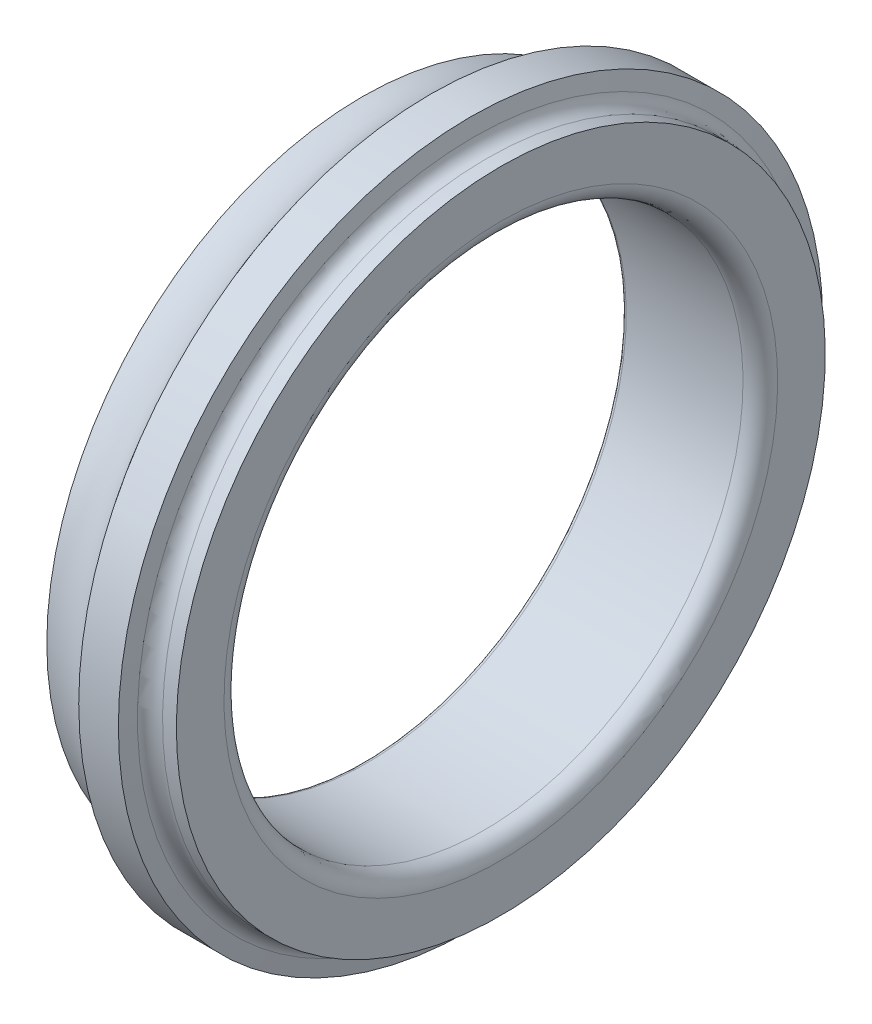
ISO-10303-21;
HEADER;
FILE_DESCRIPTION(('STEP AP214'),'2;1');
FILE_NAME('part.step','',(''),(''),'','','');
FILE_SCHEMA(('AUTOMOTIVE_DESIGN { 1 0 10303 214 1 1 1 1 }'));
ENDSEC;
DATA;
#1=APPLICATION_CONTEXT('core data for automotive mechanical design processes');
#2=APPLICATION_PROTOCOL_DEFINITION('international standard','automotive_design',2000,#1);
#3=PRODUCT_CONTEXT('',#1,'mechanical');
#4=PRODUCT('Part','Part','',(#3));
#5=PRODUCT_RELATED_PRODUCT_CATEGORY('part','',(#4));
#6=PRODUCT_DEFINITION_FORMATION('','',#4);
#7=PRODUCT_DEFINITION_CONTEXT('part definition',#1,'design');
#8=PRODUCT_DEFINITION('design','',#6,#7);
#9=PRODUCT_DEFINITION_SHAPE('','',#8);
#10=(LENGTH_UNIT() NAMED_UNIT(*) SI_UNIT(.MILLI.,.METRE.));
#11=(NAMED_UNIT(*) PLANE_ANGLE_UNIT() SI_UNIT($,.RADIAN.));
#12=(NAMED_UNIT(*) SI_UNIT($,.STERADIAN.) SOLID_ANGLE_UNIT());
#13=UNCERTAINTY_MEASURE_WITH_UNIT(LENGTH_MEASURE(1.E-05),#10,'distance_accuracy_value','');
#14=(GEOMETRIC_REPRESENTATION_CONTEXT(3) GLOBAL_UNCERTAINTY_ASSIGNED_CONTEXT((#13)) GLOBAL_UNIT_ASSIGNED_CONTEXT((#10,
#11,#12)) REPRESENTATION_CONTEXT('',''));
#15=CARTESIAN_POINT('',(0.,0.,0.));
#16=DIRECTION('',(0.,0.,1.));
#17=DIRECTION('',(1.,0.,0.));
#18=AXIS2_PLACEMENT_3D('',#15,#16,#17);
#19=CARTESIAN_POINT('',(8.,0.,0.));
#20=DIRECTION('',(-1.,0.,0.));
#21=DIRECTION('',(0.,0.,1.));
#22=AXIS2_PLACEMENT_3D('',#19,#20,#21);
#23=TOROIDAL_SURFACE('',#22,23.,4.7625);
#24=CARTESIAN_POINT('',(11.9571335901129,0.,0.));
#25=DIRECTION('',(-1.,0.,0.));
#26=DIRECTION('',(0.,1.,0.));
#27=AXIS2_PLACEMENT_3D('',#24,#25,#26);
#28=CIRCLE('',#27,20.35);
#29=CARTESIAN_POINT('',(11.9571335901129,20.35,0.));
#30=VERTEX_POINT('',#29);
#31=EDGE_CURVE('E11',#30,#30,#28,.T.);
#32=ORIENTED_EDGE('',*,*,#31,.T.);
#33=EDGE_LOOP('',(#32));
#34=FACE_BOUND('',#33,.T.);
#35=CARTESIAN_POINT('',(8.,0.,0.));
#36=DIRECTION('',(-1.,0.,0.));
#37=DIRECTION('',(0.,1.,0.));
#38=AXIS2_PLACEMENT_3D('',#35,#36,#37);
#39=CIRCLE('',#38,18.2375);
#40=CARTESIAN_POINT('',(8.,18.2375,0.));
#41=VERTEX_POINT('',#40);
#42=EDGE_CURVE('E59',#41,#41,#39,.T.);
#43=ORIENTED_EDGE('',*,*,#42,.F.);
#44=EDGE_LOOP('',(#43));
#45=FACE_BOUND('',#44,.T.);
#46=ADVANCED_FACE('F16',(#34,#45),#23,.F.);
#47=CARTESIAN_POINT('',(13.1018653580188,0.,0.));
#48=DIRECTION('',(1.,0.,0.));
#49=DIRECTION('',(0.,1.,0.));
#50=AXIS2_PLACEMENT_3D('',#47,#48,#49);
#51=CYLINDRICAL_SURFACE('',#50,20.35);
#52=CARTESIAN_POINT('',(14.2465971259246,0.,0.));
#53=DIRECTION('',(-1.,0.,0.));
#54=DIRECTION('',(0.,1.,0.));
#55=AXIS2_PLACEMENT_3D('',#52,#53,#54);
#56=CIRCLE('',#55,20.35);
#57=CARTESIAN_POINT('',(14.2465971259246,20.35,0.));
#58=VERTEX_POINT('',#57);
#59=EDGE_CURVE('E25',#58,#58,#56,.T.);
#60=ORIENTED_EDGE('',*,*,#59,.T.);
#61=EDGE_LOOP('',(#60));
#62=FACE_BOUND('',#61,.T.);
#63=ORIENTED_EDGE('',*,*,#31,.F.);
#64=EDGE_LOOP('',(#63));
#65=FACE_BOUND('',#64,.T.);
#66=ADVANCED_FACE('F88',(#62,#65),#51,.T.);
#67=CARTESIAN_POINT('',(14.3293754617574,0.,0.));
#68=DIRECTION('',(-1.,0.,0.));
#69=DIRECTION('',(0.,1.,0.));
#70=AXIS2_PLACEMENT_3D('',#67,#68,#69);
#71=CONICAL_SURFACE('',#70,19.8805407289332,1.39626340159546);
#72=CARTESIAN_POINT('',(14.4121537975902,0.,0.));
#73=DIRECTION('',(-1.,0.,0.));
#74=DIRECTION('',(0.,1.,0.));
#75=AXIS2_PLACEMENT_3D('',#72,#73,#74);
#76=CIRCLE('',#75,19.4110814578664);
#77=CARTESIAN_POINT('',(14.4121537975902,19.4110814578664,0.));
#78=VERTEX_POINT('',#77);
#79=EDGE_CURVE('E66',#78,#78,#76,.T.);
#80=ORIENTED_EDGE('',*,*,#79,.T.);
#81=EDGE_LOOP('',(#80));
#82=FACE_BOUND('',#81,.T.);
#83=ORIENTED_EDGE('',*,*,#59,.F.);
#84=EDGE_LOOP('',(#83));
#85=FACE_BOUND('',#84,.T.);
#86=ADVANCED_FACE('F92',(#82,#85),#71,.T.);
#87=CARTESIAN_POINT('',(15.2,0.,0.));
#88=DIRECTION('',(-1.,0.,0.));
#89=DIRECTION('',(0.,0.,1.));
#90=AXIS2_PLACEMENT_3D('',#87,#88,#89);
#91=TOROIDAL_SURFACE('',#90,19.55,0.8);
#92=CARTESIAN_POINT('',(15.2,0.,0.));
#93=DIRECTION('',(-1.,0.,0.));
#94=DIRECTION('',(0.,1.,0.));
#95=AXIS2_PLACEMENT_3D('',#92,#93,#94);
#96=CIRCLE('',#95,18.75);
#97=CARTESIAN_POINT('',(15.2,18.75,0.));
#98=VERTEX_POINT('',#97);
#99=EDGE_CURVE('E64',#98,#98,#96,.T.);
#100=ORIENTED_EDGE('',*,*,#99,.T.);
#101=EDGE_LOOP('',(#100));
#102=FACE_BOUND('',#101,.T.);
#103=ORIENTED_EDGE('',*,*,#79,.F.);
#104=EDGE_LOOP('',(#103));
#105=FACE_BOUND('',#104,.T.);
#106=ADVANCED_FACE('F100',(#102,#105),#91,.F.);
#107=CARTESIAN_POINT('',(15.6,0.,0.));
#108=DIRECTION('',(1.,0.,0.));
#109=DIRECTION('',(0.,1.,0.));
#110=AXIS2_PLACEMENT_3D('',#107,#108,#109);
#111=CYLINDRICAL_SURFACE('',#110,18.75);
#112=CARTESIAN_POINT('',(16.,0.,0.));
#113=DIRECTION('',(-1.,0.,0.));
#114=DIRECTION('',(0.,1.,0.));
#115=AXIS2_PLACEMENT_3D('',#112,#113,#114);
#116=CIRCLE('',#115,18.75);
#117=CARTESIAN_POINT('',(16.,18.75,0.));
#118=VERTEX_POINT('',#117);
#119=EDGE_CURVE('E67',#118,#118,#116,.T.);
#120=ORIENTED_EDGE('',*,*,#119,.T.);
#121=EDGE_LOOP('',(#120));
#122=FACE_BOUND('',#121,.T.);
#123=ORIENTED_EDGE('',*,*,#99,.F.);
#124=EDGE_LOOP('',(#123));
#125=FACE_BOUND('',#124,.T.);
#126=ADVANCED_FACE('F115',(#122,#125),#111,.T.);
#127=CARTESIAN_POINT('',(16.,17.375,0.));
#128=DIRECTION('',(1.,0.,0.));
#129=DIRECTION('',(0.,-1.,0.));
#130=AXIS2_PLACEMENT_3D('',#127,#128,#129);
#131=PLANE('',#130);
#132=CARTESIAN_POINT('',(16.,0.,0.));
#133=DIRECTION('',(-1.,0.,0.));
#134=DIRECTION('',(0.,1.,0.));
#135=AXIS2_PLACEMENT_3D('',#132,#133,#134);
#136=CIRCLE('',#135,16.);
#137=CARTESIAN_POINT('',(16.,16.,0.));
#138=VERTEX_POINT('',#137);
#139=EDGE_CURVE('E61',#138,#138,#136,.T.);
#140=ORIENTED_EDGE('',*,*,#139,.T.);
#141=EDGE_LOOP('',(#140));
#142=FACE_BOUND('',#141,.T.);
#143=ORIENTED_EDGE('',*,*,#119,.F.);
#144=EDGE_LOOP('',(#143));
#145=FACE_BOUND('',#144,.T.);
#146=ADVANCED_FACE('F110',(#142,#145),#131,.T.);
#147=CARTESIAN_POINT('',(15.,0.,0.));
#148=DIRECTION('',(-1.,0.,0.));
#149=DIRECTION('',(0.,0.,1.));
#150=AXIS2_PLACEMENT_3D('',#147,#148,#149);
#151=TOROIDAL_SURFACE('',#150,16.,1.);
#152=CARTESIAN_POINT('',(15.,0.,0.));
#153=DIRECTION('',(-1.,0.,0.));
#154=DIRECTION('',(0.,1.,0.));
#155=AXIS2_PLACEMENT_3D('',#152,#153,#154);
#156=CIRCLE('',#155,15.);
#157=CARTESIAN_POINT('',(15.,15.,0.));
#158=VERTEX_POINT('',#157);
#159=EDGE_CURVE('E19',#158,#158,#156,.T.);
#160=ORIENTED_EDGE('',*,*,#159,.T.);
#161=EDGE_LOOP('',(#160));
#162=FACE_BOUND('',#161,.T.);
#163=ORIENTED_EDGE('',*,*,#139,.F.);
#164=EDGE_LOOP('',(#163));
#165=FACE_BOUND('',#164,.T.);
#166=ADVANCED_FACE('F106',(#162,#165),#151,.T.);
#167=CARTESIAN_POINT('',(11.625,0.,0.));
#168=DIRECTION('',(1.,0.,0.));
#169=DIRECTION('',(0.,1.,0.));
#170=AXIS2_PLACEMENT_3D('',#167,#168,#169);
#171=CYLINDRICAL_SURFACE('',#170,15.);
#172=CARTESIAN_POINT('',(8.25,0.,0.));
#173=DIRECTION('',(-1.,0.,0.));
#174=DIRECTION('',(0.,1.,0.));
#175=AXIS2_PLACEMENT_3D('',#172,#173,#174);
#176=CIRCLE('',#175,15.);
#177=CARTESIAN_POINT('',(8.25,15.,0.));
#178=VERTEX_POINT('',#177);
#179=EDGE_CURVE('E55',#178,#178,#176,.T.);
#180=ORIENTED_EDGE('',*,*,#179,.T.);
#181=EDGE_LOOP('',(#180));
#182=FACE_BOUND('',#181,.T.);
#183=ORIENTED_EDGE('',*,*,#159,.F.);
#184=EDGE_LOOP('',(#183));
#185=FACE_BOUND('',#184,.T.);
#186=ADVANCED_FACE('F56',(#182,#185),#171,.F.);
#187=CARTESIAN_POINT('',(8.25,0.,0.));
#188=DIRECTION('',(-1.,0.,0.));
#189=DIRECTION('',(0.,0.,1.));
#190=AXIS2_PLACEMENT_3D('',#187,#188,#189);
#191=TOROIDAL_SURFACE('',#190,15.25,0.25);
#192=CARTESIAN_POINT('',(8.,0.,0.));
#193=DIRECTION('',(-1.,0.,0.));
#194=DIRECTION('',(0.,1.,0.));
#195=AXIS2_PLACEMENT_3D('',#192,#193,#194);
#196=CIRCLE('',#195,15.25);
#197=CARTESIAN_POINT('',(8.,15.25,0.));
#198=VERTEX_POINT('',#197);
#199=EDGE_CURVE('E62',#198,#198,#196,.T.);
#200=ORIENTED_EDGE('',*,*,#199,.T.);
#201=EDGE_LOOP('',(#200));
#202=FACE_BOUND('',#201,.T.);
#203=ORIENTED_EDGE('',*,*,#179,.F.);
#204=EDGE_LOOP('',(#203));
#205=FACE_BOUND('',#204,.T.);
#206=ADVANCED_FACE('F75',(#202,#205),#191,.T.);
#207=CARTESIAN_POINT('',(8.,16.74375,0.));
#208=DIRECTION('',(-1.,0.,0.));
#209=DIRECTION('',(0.,1.,0.));
#210=AXIS2_PLACEMENT_3D('',#207,#208,#209);
#211=PLANE('',#210);
#212=ORIENTED_EDGE('',*,*,#42,.T.);
#213=EDGE_LOOP('',(#212));
#214=FACE_BOUND('',#213,.T.);
#215=ORIENTED_EDGE('',*,*,#199,.F.);
#216=EDGE_LOOP('',(#215));
#217=FACE_BOUND('',#216,.T.);
#218=ADVANCED_FACE('F77',(#214,#217),#211,.T.);
#219=CLOSED_SHELL('',(#46,#66,#86,#106,#126,#146,#166,#186,#206,#218));
#220=MANIFOLD_SOLID_BREP('B1',#219);
#221=ADVANCED_BREP_SHAPE_REPRESENTATION('',(#18,#220),#14);
#222=SHAPE_DEFINITION_REPRESENTATION(#9,#221);
ENDSEC;
END-ISO-10303-21;
